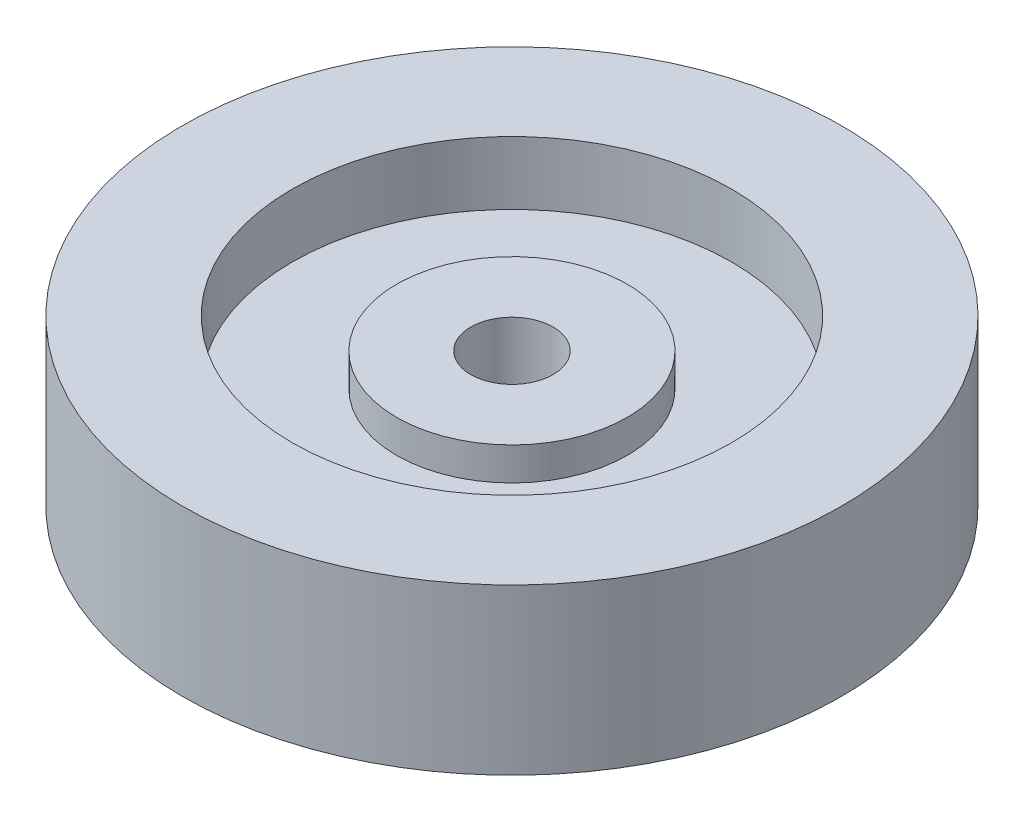
ISO-10303-21;
HEADER;
FILE_DESCRIPTION(('STEP AP214'),'2;1');
FILE_NAME('part.step','',(''),(''),'','','');
FILE_SCHEMA(('AUTOMOTIVE_DESIGN { 1 0 10303 214 1 1 1 1 }'));
ENDSEC;
DATA;
#1=APPLICATION_CONTEXT('core data for automotive mechanical design processes');
#2=APPLICATION_PROTOCOL_DEFINITION('international standard','automotive_design',2000,#1);
#3=PRODUCT_CONTEXT('',#1,'mechanical');
#4=PRODUCT('Part','Part','',(#3));
#5=PRODUCT_RELATED_PRODUCT_CATEGORY('part','',(#4));
#6=PRODUCT_DEFINITION_FORMATION('','',#4);
#7=PRODUCT_DEFINITION_CONTEXT('part definition',#1,'design');
#8=PRODUCT_DEFINITION('design','',#6,#7);
#9=PRODUCT_DEFINITION_SHAPE('','',#8);
#10=(LENGTH_UNIT() NAMED_UNIT(*) SI_UNIT(.MILLI.,.METRE.));
#11=(NAMED_UNIT(*) PLANE_ANGLE_UNIT() SI_UNIT($,.RADIAN.));
#12=(NAMED_UNIT(*) SI_UNIT($,.STERADIAN.) SOLID_ANGLE_UNIT());
#13=UNCERTAINTY_MEASURE_WITH_UNIT(LENGTH_MEASURE(1.E-05),#10,'distance_accuracy_value','');
#14=(GEOMETRIC_REPRESENTATION_CONTEXT(3) GLOBAL_UNCERTAINTY_ASSIGNED_CONTEXT((#13)) GLOBAL_UNIT_ASSIGNED_CONTEXT((#10,
#11,#12)) REPRESENTATION_CONTEXT('',''));
#15=CARTESIAN_POINT('',(0.,0.,0.));
#16=DIRECTION('',(0.,0.,1.));
#17=DIRECTION('',(1.,0.,0.));
#18=AXIS2_PLACEMENT_3D('',#15,#16,#17);
#19=CARTESIAN_POINT('',(0.,-10.5,0.));
#20=DIRECTION('',(0.,1.,0.));
#21=DIRECTION('',(0.,0.,1.));
#22=AXIS2_PLACEMENT_3D('',#19,#20,#21);
#23=CYLINDRICAL_SURFACE('',#22,7.5);
#24=CARTESIAN_POINT('',(0.,9.5,0.));
#25=DIRECTION('',(0.,1.,0.));
#26=DIRECTION('',(0.,0.,1.));
#27=AXIS2_PLACEMENT_3D('',#24,#25,#26);
#28=CIRCLE('',#27,7.5);
#29=CARTESIAN_POINT('',(0.,9.5,7.5));
#30=VERTEX_POINT('',#29);
#31=EDGE_CURVE('E59',#30,#30,#28,.T.);
#32=ORIENTED_EDGE('',*,*,#31,.T.);
#33=EDGE_LOOP('',(#32));
#34=FACE_BOUND('',#33,.T.);
#35=CARTESIAN_POINT('',(0.,-9.5,0.));
#36=DIRECTION('',(0.,1.,0.));
#37=DIRECTION('',(0.,0.,1.));
#38=AXIS2_PLACEMENT_3D('',#35,#36,#37);
#39=CIRCLE('',#38,7.5);
#40=CARTESIAN_POINT('',(0.,-9.5,7.5));
#41=VERTEX_POINT('',#40);
#42=EDGE_CURVE('E73',#41,#41,#39,.T.);
#43=ORIENTED_EDGE('',*,*,#42,.F.);
#44=EDGE_LOOP('',(#43));
#45=FACE_BOUND('',#44,.T.);
#46=ADVANCED_FACE('F32',(#34,#45),#23,.F.);
#47=CARTESIAN_POINT('',(0.,-15.,0.));
#48=DIRECTION('',(0.,1.,0.));
#49=DIRECTION('',(0.,0.,1.));
#50=AXIS2_PLACEMENT_3D('',#47,#48,#49);
#51=CYLINDRICAL_SURFACE('',#50,60.);
#52=CARTESIAN_POINT('',(0.,-15.,0.));
#53=DIRECTION('',(0.,1.,0.));
#54=DIRECTION('',(0.,0.,1.));
#55=AXIS2_PLACEMENT_3D('',#52,#53,#54);
#56=CIRCLE('',#55,60.);
#57=CARTESIAN_POINT('',(0.,-15.,60.));
#58=VERTEX_POINT('',#57);
#59=EDGE_CURVE('E39',#58,#58,#56,.T.);
#60=ORIENTED_EDGE('',*,*,#59,.T.);
#61=EDGE_LOOP('',(#60));
#62=FACE_BOUND('',#61,.T.);
#63=CARTESIAN_POINT('',(0.,15.,0.));
#64=DIRECTION('',(0.,1.,0.));
#65=DIRECTION('',(0.,0.,1.));
#66=AXIS2_PLACEMENT_3D('',#63,#64,#65);
#67=CIRCLE('',#66,60.);
#68=CARTESIAN_POINT('',(0.,15.,60.));
#69=VERTEX_POINT('',#68);
#70=EDGE_CURVE('E43',#69,#69,#67,.T.);
#71=ORIENTED_EDGE('',*,*,#70,.F.);
#72=EDGE_LOOP('',(#71));
#73=FACE_BOUND('',#72,.T.);
#74=ADVANCED_FACE('F34',(#62,#73),#51,.T.);
#75=CARTESIAN_POINT('',(0.,-15.,0.));
#76=DIRECTION('',(0.,1.,0.));
#77=DIRECTION('',(0.,0.,1.));
#78=AXIS2_PLACEMENT_3D('',#75,#76,#77);
#79=PLANE('',#78);
#80=CARTESIAN_POINT('',(0.,-15.,0.));
#81=DIRECTION('',(0.,1.,0.));
#82=DIRECTION('',(0.,0.,1.));
#83=AXIS2_PLACEMENT_3D('',#80,#81,#82);
#84=CIRCLE('',#83,40.);
#85=CARTESIAN_POINT('',(0.,-15.,40.));
#86=VERTEX_POINT('',#85);
#87=EDGE_CURVE('E65',#86,#86,#84,.T.);
#88=ORIENTED_EDGE('',*,*,#87,.T.);
#89=EDGE_LOOP('',(#88));
#90=FACE_BOUND('',#89,.T.);
#91=ORIENTED_EDGE('',*,*,#59,.F.);
#92=EDGE_LOOP('',(#91));
#93=FACE_BOUND('',#92,.T.);
#94=ADVANCED_FACE('F86',(#90,#93),#79,.F.);
#95=CARTESIAN_POINT('',(0.,15.,0.));
#96=DIRECTION('',(0.,1.,0.));
#97=DIRECTION('',(0.,0.,1.));
#98=AXIS2_PLACEMENT_3D('',#95,#96,#97);
#99=PLANE('',#98);
#100=CARTESIAN_POINT('',(0.,15.,0.));
#101=DIRECTION('',(0.,1.,0.));
#102=DIRECTION('',(0.,0.,1.));
#103=AXIS2_PLACEMENT_3D('',#100,#101,#102);
#104=CIRCLE('',#103,40.);
#105=CARTESIAN_POINT('',(0.,15.,40.));
#106=VERTEX_POINT('',#105);
#107=EDGE_CURVE('E50',#106,#106,#104,.T.);
#108=ORIENTED_EDGE('',*,*,#107,.F.);
#109=EDGE_LOOP('',(#108));
#110=FACE_BOUND('',#109,.T.);
#111=ORIENTED_EDGE('',*,*,#70,.T.);
#112=EDGE_LOOP('',(#111));
#113=FACE_BOUND('',#112,.T.);
#114=ADVANCED_FACE('F107',(#110,#113),#99,.T.);
#115=CARTESIAN_POINT('',(0.,3.5,0.));
#116=DIRECTION('',(0.,1.,0.));
#117=DIRECTION('',(0.,0.,1.));
#118=AXIS2_PLACEMENT_3D('',#115,#116,#117);
#119=CYLINDRICAL_SURFACE('',#118,40.);
#120=CARTESIAN_POINT('',(0.,3.5,0.));
#121=DIRECTION('',(0.,1.,0.));
#122=DIRECTION('',(0.,0.,1.));
#123=AXIS2_PLACEMENT_3D('',#120,#121,#122);
#124=CIRCLE('',#123,40.);
#125=CARTESIAN_POINT('',(0.,3.5,40.));
#126=VERTEX_POINT('',#125);
#127=EDGE_CURVE('E47',#126,#126,#124,.T.);
#128=ORIENTED_EDGE('',*,*,#127,.F.);
#129=EDGE_LOOP('',(#128));
#130=FACE_BOUND('',#129,.T.);
#131=ORIENTED_EDGE('',*,*,#107,.T.);
#132=EDGE_LOOP('',(#131));
#133=FACE_BOUND('',#132,.T.);
#134=ADVANCED_FACE('F103',(#130,#133),#119,.F.);
#135=CARTESIAN_POINT('',(0.,3.5,0.));
#136=DIRECTION('',(0.,1.,0.));
#137=DIRECTION('',(0.,0.,1.));
#138=AXIS2_PLACEMENT_3D('',#135,#136,#137);
#139=PLANE('',#138);
#140=CARTESIAN_POINT('',(0.,3.5,0.));
#141=DIRECTION('',(0.,1.,0.));
#142=DIRECTION('',(0.,0.,1.));
#143=AXIS2_PLACEMENT_3D('',#140,#141,#142);
#144=CIRCLE('',#143,21.);
#145=CARTESIAN_POINT('',(0.,3.5,21.));
#146=VERTEX_POINT('',#145);
#147=EDGE_CURVE('E56',#146,#146,#144,.T.);
#148=ORIENTED_EDGE('',*,*,#147,.F.);
#149=EDGE_LOOP('',(#148));
#150=FACE_BOUND('',#149,.T.);
#151=ORIENTED_EDGE('',*,*,#127,.T.);
#152=EDGE_LOOP('',(#151));
#153=FACE_BOUND('',#152,.T.);
#154=ADVANCED_FACE('F99',(#150,#153),#139,.T.);
#155=CARTESIAN_POINT('',(0.,9.5,0.));
#156=DIRECTION('',(0.,-1.,0.));
#157=DIRECTION('',(0.,0.,-1.));
#158=AXIS2_PLACEMENT_3D('',#155,#156,#157);
#159=CYLINDRICAL_SURFACE('',#158,21.);
#160=CARTESIAN_POINT('',(0.,9.5,0.));
#161=DIRECTION('',(0.,1.,0.));
#162=DIRECTION('',(0.,0.,1.));
#163=AXIS2_PLACEMENT_3D('',#160,#161,#162);
#164=CIRCLE('',#163,21.);
#165=CARTESIAN_POINT('',(0.,9.5,21.));
#166=VERTEX_POINT('',#165);
#167=EDGE_CURVE('E53',#166,#166,#164,.T.);
#168=ORIENTED_EDGE('',*,*,#167,.F.);
#169=EDGE_LOOP('',(#168));
#170=FACE_BOUND('',#169,.T.);
#171=ORIENTED_EDGE('',*,*,#147,.T.);
#172=EDGE_LOOP('',(#171));
#173=FACE_BOUND('',#172,.T.);
#174=ADVANCED_FACE('F95',(#170,#173),#159,.T.);
#175=CARTESIAN_POINT('',(0.,9.5,0.));
#176=DIRECTION('',(0.,1.,0.));
#177=DIRECTION('',(0.,0.,1.));
#178=AXIS2_PLACEMENT_3D('',#175,#176,#177);
#179=PLANE('',#178);
#180=ORIENTED_EDGE('',*,*,#31,.F.);
#181=EDGE_LOOP('',(#180));
#182=FACE_BOUND('',#181,.T.);
#183=ORIENTED_EDGE('',*,*,#167,.T.);
#184=EDGE_LOOP('',(#183));
#185=FACE_BOUND('',#184,.T.);
#186=ADVANCED_FACE('F91',(#182,#185),#179,.T.);
#187=CARTESIAN_POINT('',(0.,-3.5,0.));
#188=DIRECTION('',(0.,-1.,0.));
#189=DIRECTION('',(0.,0.,1.));
#190=AXIS2_PLACEMENT_3D('',#187,#188,#189);
#191=PLANE('',#190);
#192=CARTESIAN_POINT('',(0.,-3.5,0.));
#193=DIRECTION('',(0.,-1.,0.));
#194=DIRECTION('',(0.,0.,-1.));
#195=AXIS2_PLACEMENT_3D('',#192,#193,#194);
#196=CIRCLE('',#195,21.);
#197=CARTESIAN_POINT('',(0.,-3.5,-21.));
#198=VERTEX_POINT('',#197);
#199=EDGE_CURVE('E10',#198,#198,#196,.T.);
#200=ORIENTED_EDGE('',*,*,#199,.F.);
#201=EDGE_LOOP('',(#200));
#202=FACE_BOUND('',#201,.T.);
#203=CARTESIAN_POINT('',(0.,-3.5,0.));
#204=DIRECTION('',(0.,1.,0.));
#205=DIRECTION('',(0.,0.,1.));
#206=AXIS2_PLACEMENT_3D('',#203,#204,#205);
#207=CIRCLE('',#206,40.);
#208=CARTESIAN_POINT('',(0.,-3.5,40.));
#209=VERTEX_POINT('',#208);
#210=EDGE_CURVE('E64',#209,#209,#207,.T.);
#211=ORIENTED_EDGE('',*,*,#210,.F.);
#212=EDGE_LOOP('',(#211));
#213=FACE_BOUND('',#212,.T.);
#214=ADVANCED_FACE('F94',(#202,#213),#191,.T.);
#215=CARTESIAN_POINT('',(0.,-3.5,0.));
#216=DIRECTION('',(0.,-1.,0.));
#217=DIRECTION('',(0.,0.,-1.));
#218=AXIS2_PLACEMENT_3D('',#215,#216,#217);
#219=CYLINDRICAL_SURFACE('',#218,40.);
#220=ORIENTED_EDGE('',*,*,#210,.T.);
#221=EDGE_LOOP('',(#220));
#222=FACE_BOUND('',#221,.T.);
#223=ORIENTED_EDGE('',*,*,#87,.F.);
#224=EDGE_LOOP('',(#223));
#225=FACE_BOUND('',#224,.T.);
#226=ADVANCED_FACE('F89',(#222,#225),#219,.F.);
#227=CARTESIAN_POINT('',(0.,-9.5,0.));
#228=DIRECTION('',(0.,-1.,0.));
#229=DIRECTION('',(0.,0.,1.));
#230=AXIS2_PLACEMENT_3D('',#227,#228,#229);
#231=PLANE('',#230);
#232=ORIENTED_EDGE('',*,*,#42,.T.);
#233=EDGE_LOOP('',(#232));
#234=FACE_BOUND('',#233,.T.);
#235=CARTESIAN_POINT('',(0.,-9.5,0.));
#236=DIRECTION('',(0.,1.,0.));
#237=DIRECTION('',(0.,0.,1.));
#238=AXIS2_PLACEMENT_3D('',#235,#236,#237);
#239=CIRCLE('',#238,21.);
#240=CARTESIAN_POINT('',(0.,-9.5,21.));
#241=VERTEX_POINT('',#240);
#242=EDGE_CURVE('E68',#241,#241,#239,.T.);
#243=ORIENTED_EDGE('',*,*,#242,.F.);
#244=EDGE_LOOP('',(#243));
#245=FACE_BOUND('',#244,.T.);
#246=ADVANCED_FACE('F77',(#234,#245),#231,.T.);
#247=CARTESIAN_POINT('',(0.,-9.5,0.));
#248=DIRECTION('',(0.,1.,0.));
#249=DIRECTION('',(0.,0.,1.));
#250=AXIS2_PLACEMENT_3D('',#247,#248,#249);
#251=CYLINDRICAL_SURFACE('',#250,21.);
#252=ORIENTED_EDGE('',*,*,#242,.T.);
#253=EDGE_LOOP('',(#252));
#254=FACE_BOUND('',#253,.T.);
#255=ORIENTED_EDGE('',*,*,#199,.T.);
#256=EDGE_LOOP('',(#255));
#257=FACE_BOUND('',#256,.T.);
#258=ADVANCED_FACE('F124',(#254,#257),#251,.T.);
#259=CLOSED_SHELL('',(#46,#74,#94,#114,#134,#154,#174,#186,#214,#226,#246,#258));
#260=MANIFOLD_SOLID_BREP('B2',#259);
#261=ADVANCED_BREP_SHAPE_REPRESENTATION('',(#18,#260),#14);
#262=SHAPE_DEFINITION_REPRESENTATION(#9,#261);
ENDSEC;
END-ISO-10303-21;
